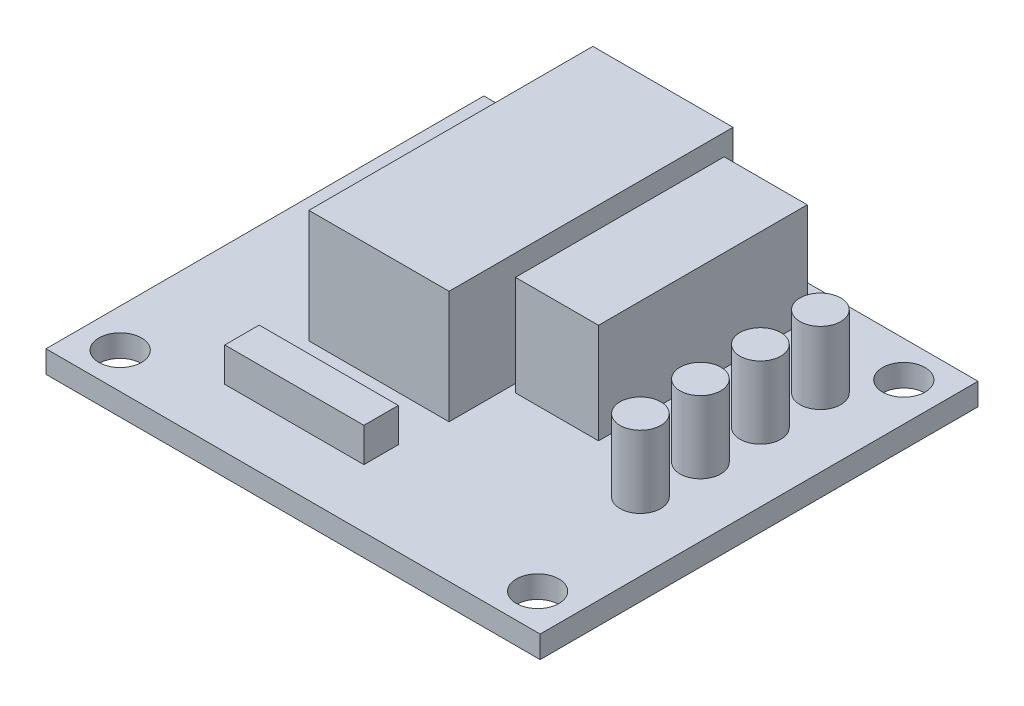
ISO-10303-21;
HEADER;
FILE_DESCRIPTION(('STEP AP214'),'2;1');
FILE_NAME('part.step','',(''),(''),'','','');
FILE_SCHEMA(('AUTOMOTIVE_DESIGN { 1 0 10303 214 1 1 1 1 }'));
ENDSEC;
DATA;
#1=APPLICATION_CONTEXT('core data for automotive mechanical design processes');
#2=APPLICATION_PROTOCOL_DEFINITION('international standard','automotive_design',2000,#1);
#3=PRODUCT_CONTEXT('',#1,'mechanical');
#4=PRODUCT('Part','Part','',(#3));
#5=PRODUCT_RELATED_PRODUCT_CATEGORY('part','',(#4));
#6=PRODUCT_DEFINITION_FORMATION('','',#4);
#7=PRODUCT_DEFINITION_CONTEXT('part definition',#1,'design');
#8=PRODUCT_DEFINITION('design','',#6,#7);
#9=PRODUCT_DEFINITION_SHAPE('','',#8);
#10=(LENGTH_UNIT() NAMED_UNIT(*) SI_UNIT(.MILLI.,.METRE.));
#11=(NAMED_UNIT(*) PLANE_ANGLE_UNIT() SI_UNIT($,.RADIAN.));
#12=(NAMED_UNIT(*) SI_UNIT($,.STERADIAN.) SOLID_ANGLE_UNIT());
#13=UNCERTAINTY_MEASURE_WITH_UNIT(LENGTH_MEASURE(1.E-05),#10,'distance_accuracy_value','');
#14=(GEOMETRIC_REPRESENTATION_CONTEXT(3) GLOBAL_UNCERTAINTY_ASSIGNED_CONTEXT((#13)) GLOBAL_UNIT_ASSIGNED_CONTEXT((#10,
#11,#12)) REPRESENTATION_CONTEXT('',''));
#15=CARTESIAN_POINT('',(0.,0.,0.));
#16=DIRECTION('',(0.,0.,1.));
#17=DIRECTION('',(1.,0.,0.));
#18=AXIS2_PLACEMENT_3D('',#15,#16,#17);
#19=CARTESIAN_POINT('',(0.,1.5875,0.));
#20=DIRECTION('',(0.,1.,0.));
#21=DIRECTION('',(0.,0.,1.));
#22=AXIS2_PLACEMENT_3D('',#19,#20,#21);
#23=PLANE('',#22);
#24=CARTESIAN_POINT('',(12.7635,1.5875,3.57505));
#25=DIRECTION('',(0.,1.,0.));
#26=DIRECTION('',(0.,0.,1.));
#27=AXIS2_PLACEMENT_3D('',#24,#25,#26);
#28=CIRCLE('',#27,1.4605);
#29=CARTESIAN_POINT('',(12.7635,1.5875,5.03555));
#30=VERTEX_POINT('',#29);
#31=EDGE_CURVE('E583',#30,#30,#28,.T.);
#32=ORIENTED_EDGE('',*,*,#31,.F.);
#33=EDGE_LOOP('',(#32));
#34=FACE_BOUND('',#33,.T.);
#35=CARTESIAN_POINT('',(12.7635,1.5875,-0.717549999999997));
#36=DIRECTION('',(0.,1.,0.));
#37=DIRECTION('',(0.,0.,1.));
#38=AXIS2_PLACEMENT_3D('',#35,#36,#37);
#39=CIRCLE('',#38,1.4605);
#40=CARTESIAN_POINT('',(12.7635,1.5875,0.742950000000003));
#41=VERTEX_POINT('',#40);
#42=EDGE_CURVE('E582',#41,#41,#39,.T.);
#43=ORIENTED_EDGE('',*,*,#42,.F.);
#44=EDGE_LOOP('',(#43));
#45=FACE_BOUND('',#44,.T.);
#46=CARTESIAN_POINT('',(12.7635,1.5875,-5.01015));
#47=DIRECTION('',(0.,1.,0.));
#48=DIRECTION('',(0.,0.,1.));
#49=AXIS2_PLACEMENT_3D('',#46,#47,#48);
#50=CIRCLE('',#49,1.4605);
#51=CARTESIAN_POINT('',(12.7635,1.5875,-3.54965));
#52=VERTEX_POINT('',#51);
#53=EDGE_CURVE('E595',#52,#52,#50,.T.);
#54=ORIENTED_EDGE('',*,*,#53,.F.);
#55=EDGE_LOOP('',(#54));
#56=FACE_BOUND('',#55,.T.);
#57=CARTESIAN_POINT('',(12.7635,1.5875,-9.30275));
#58=DIRECTION('',(0.,1.,0.));
#59=DIRECTION('',(0.,0.,1.));
#60=AXIS2_PLACEMENT_3D('',#57,#58,#59);
#61=CIRCLE('',#60,1.4605);
#62=CARTESIAN_POINT('',(12.7635,1.5875,-7.84225));
#63=VERTEX_POINT('',#62);
#64=EDGE_CURVE('E601',#63,#63,#61,.T.);
#65=ORIENTED_EDGE('',*,*,#64,.F.);
#66=EDGE_LOOP('',(#65));
#67=FACE_BOUND('',#66,.T.);
#68=CARTESIAN_POINT('',(-14.9352,1.5875,13.10005));
#69=DIRECTION('',(0.,1.,0.));
#70=DIRECTION('',(0.,0.,-1.));
#71=AXIS2_PLACEMENT_3D('',#68,#69,#70);
#72=CIRCLE('',#71,1.524);
#73=CARTESIAN_POINT('',(-14.9352,1.5875,11.57605));
#74=VERTEX_POINT('',#73);
#75=EDGE_CURVE('E343',#74,#74,#72,.T.);
#76=ORIENTED_EDGE('',*,*,#75,.F.);
#77=EDGE_LOOP('',(#76));
#78=FACE_BOUND('',#77,.T.);
#79=CARTESIAN_POINT('',(14.9352,1.5875,13.10005));
#80=DIRECTION('',(0.,1.,0.));
#81=DIRECTION('',(0.,0.,1.));
#82=AXIS2_PLACEMENT_3D('',#79,#80,#81);
#83=CIRCLE('',#82,1.524);
#84=CARTESIAN_POINT('',(14.9352,1.5875,14.62405));
#85=VERTEX_POINT('',#84);
#86=EDGE_CURVE('E359',#85,#85,#83,.T.);
#87=ORIENTED_EDGE('',*,*,#86,.F.);
#88=EDGE_LOOP('',(#87));
#89=FACE_BOUND('',#88,.T.);
#90=DIRECTION('',(0.,0.,-1.));
#91=VECTOR('',#90,1.);
#92=CARTESIAN_POINT('',(17.6784,1.5875,-15.66545));
#93=LINE('',#92,#91);
#94=CARTESIAN_POINT('',(17.6784,1.5875,15.66545));
#95=VERTEX_POINT('',#94);
#96=CARTESIAN_POINT('',(17.6784,1.5875,-15.66545));
#97=VERTEX_POINT('',#96);
#98=EDGE_CURVE('E367',#95,#97,#93,.T.);
#99=ORIENTED_EDGE('',*,*,#98,.T.);
#100=DIRECTION('',(-1.,0.,0.));
#101=VECTOR('',#100,1.);
#102=CARTESIAN_POINT('',(-17.6784,1.5875,-15.66545));
#103=LINE('',#102,#101);
#104=CARTESIAN_POINT('',(-17.6784,1.5875,-15.66545));
#105=VERTEX_POINT('',#104);
#106=EDGE_CURVE('E371',#97,#105,#103,.T.);
#107=ORIENTED_EDGE('',*,*,#106,.T.);
#108=DIRECTION('',(0.,0.,1.));
#109=VECTOR('',#108,1.);
#110=CARTESIAN_POINT('',(-17.6784,1.5875,-15.66545));
#111=LINE('',#110,#109);
#112=CARTESIAN_POINT('',(-17.6784,1.5875,15.66545));
#113=VERTEX_POINT('',#112);
#114=EDGE_CURVE('E375',#105,#113,#111,.T.);
#115=ORIENTED_EDGE('',*,*,#114,.T.);
#116=DIRECTION('',(1.,0.,0.));
#117=VECTOR('',#116,1.);
#118=CARTESIAN_POINT('',(-17.6784,1.5875,15.66545));
#119=LINE('',#118,#117);
#120=EDGE_CURVE('E378',#113,#95,#119,.T.);
#121=ORIENTED_EDGE('',*,*,#120,.T.);
#122=EDGE_LOOP('',(#99,#107,#115,#121));
#123=FACE_BOUND('',#122,.T.);
#124=CARTESIAN_POINT('',(14.9352,1.5875,-13.10005));
#125=DIRECTION('',(0.,1.,0.));
#126=DIRECTION('',(0.,0.,-1.));
#127=AXIS2_PLACEMENT_3D('',#124,#125,#126);
#128=CIRCLE('',#127,1.524);
#129=CARTESIAN_POINT('',(14.9352,1.5875,-14.62405));
#130=VERTEX_POINT('',#129);
#131=EDGE_CURVE('E351',#130,#130,#128,.T.);
#132=ORIENTED_EDGE('',*,*,#131,.F.);
#133=EDGE_LOOP('',(#132));
#134=FACE_BOUND('',#133,.T.);
#135=CARTESIAN_POINT('',(-14.9352,1.5875,-13.10005));
#136=DIRECTION('',(0.,1.,0.));
#137=DIRECTION('',(0.,0.,1.));
#138=AXIS2_PLACEMENT_3D('',#135,#136,#137);
#139=CIRCLE('',#138,1.524);
#140=CARTESIAN_POINT('',(-14.9352,1.5875,-11.57605));
#141=VERTEX_POINT('',#140);
#142=EDGE_CURVE('E335',#141,#141,#139,.T.);
#143=ORIENTED_EDGE('',*,*,#142,.F.);
#144=EDGE_LOOP('',(#143));
#145=FACE_BOUND('',#144,.T.);
#146=DIRECTION('',(-1.,0.,0.));
#147=VECTOR('',#146,1.);
#148=CARTESIAN_POINT('',(-12.1666,1.5875,-10.29335));
#149=LINE('',#148,#147);
#150=CARTESIAN_POINT('',(-9.7028,1.5875,-10.29335));
#151=VERTEX_POINT('',#150);
#152=CARTESIAN_POINT('',(-12.1666,1.5875,-10.29335));
#153=VERTEX_POINT('',#152);
#154=EDGE_CURVE('E312',#151,#153,#149,.T.);
#155=ORIENTED_EDGE('',*,*,#154,.F.);
#156=DIRECTION('',(0.,0.,-1.));
#157=VECTOR('',#156,1.);
#158=CARTESIAN_POINT('',(-9.7028,1.5875,-0.336549999999998));
#159=LINE('',#158,#157);
#160=CARTESIAN_POINT('',(-9.7028,1.5875,-0.336549999999998));
#161=VERTEX_POINT('',#160);
#162=EDGE_CURVE('E293',#161,#151,#159,.T.);
#163=ORIENTED_EDGE('',*,*,#162,.F.);
#164=DIRECTION('',(1.,0.,0.));
#165=VECTOR('',#164,1.);
#166=CARTESIAN_POINT('',(-12.1666,1.5875,-0.336549999999998));
#167=LINE('',#166,#165);
#168=CARTESIAN_POINT('',(-12.1666,1.5875,-0.336549999999998));
#169=VERTEX_POINT('',#168);
#170=EDGE_CURVE('E299',#169,#161,#167,.T.);
#171=ORIENTED_EDGE('',*,*,#170,.F.);
#172=DIRECTION('',(0.,0.,1.));
#173=VECTOR('',#172,1.);
#174=CARTESIAN_POINT('',(-12.1666,1.5875,-0.336549999999998));
#175=LINE('',#174,#173);
#176=EDGE_CURVE('E315',#153,#169,#175,.T.);
#177=ORIENTED_EDGE('',*,*,#176,.F.);
#178=EDGE_LOOP('',(#155,#163,#171,#177));
#179=FACE_BOUND('',#178,.T.);
#180=DIRECTION('',(-1.,0.,0.));
#181=VECTOR('',#180,1.);
#182=CARTESIAN_POINT('',(-9.08050000000001,1.5875,9.01065));
#183=LINE('',#182,#181);
#184=CARTESIAN_POINT('',(0.876299999999995,1.5875,9.01065));
#185=VERTEX_POINT('',#184);
#186=CARTESIAN_POINT('',(-9.08050000000001,1.5875,9.01065));
#187=VERTEX_POINT('',#186);
#188=EDGE_CURVE('E271',#185,#187,#183,.T.);
#189=ORIENTED_EDGE('',*,*,#188,.F.);
#190=DIRECTION('',(0.,0.,-1.));
#191=VECTOR('',#190,1.);
#192=CARTESIAN_POINT('',(0.876299999999995,1.5875,9.01065));
#193=LINE('',#192,#191);
#194=CARTESIAN_POINT('',(0.876299999999995,1.5875,11.47445));
#195=VERTEX_POINT('',#194);
#196=EDGE_CURVE('E252',#195,#185,#193,.T.);
#197=ORIENTED_EDGE('',*,*,#196,.F.);
#198=DIRECTION('',(1.,0.,0.));
#199=VECTOR('',#198,1.);
#200=CARTESIAN_POINT('',(-9.0805,1.5875,11.47445));
#201=LINE('',#200,#199);
#202=CARTESIAN_POINT('',(-9.0805,1.5875,11.47445));
#203=VERTEX_POINT('',#202);
#204=EDGE_CURVE('E258',#203,#195,#201,.T.);
#205=ORIENTED_EDGE('',*,*,#204,.F.);
#206=DIRECTION('',(0.,0.,1.));
#207=VECTOR('',#206,1.);
#208=CARTESIAN_POINT('',(-9.08050000000001,1.5875,9.01065));
#209=LINE('',#208,#207);
#210=EDGE_CURVE('E274',#187,#203,#209,.T.);
#211=ORIENTED_EDGE('',*,*,#210,.F.);
#212=EDGE_LOOP('',(#189,#197,#205,#211));
#213=FACE_BOUND('',#212,.T.);
#214=DIRECTION('',(1.,0.,0.));
#215=VECTOR('',#214,1.);
#216=CARTESIAN_POINT('',(-8.763,1.5875,5.77215));
#217=LINE('',#216,#215);
#218=CARTESIAN_POINT('',(-8.763,1.5875,5.77215));
#219=VERTEX_POINT('',#218);
#220=CARTESIAN_POINT('',(1.27,1.5875,5.77215));
#221=VERTEX_POINT('',#220);
#222=EDGE_CURVE('E213',#219,#221,#217,.T.);
#223=ORIENTED_EDGE('',*,*,#222,.F.);
#224=DIRECTION('',(0.,0.,1.));
#225=VECTOR('',#224,1.);
#226=CARTESIAN_POINT('',(-8.76300000000001,1.5875,-14.54785));
#227=LINE('',#226,#225);
#228=CARTESIAN_POINT('',(-8.76300000000001,1.5875,-14.54785));
#229=VERTEX_POINT('',#228);
#230=EDGE_CURVE('E208',#229,#219,#227,.T.);
#231=ORIENTED_EDGE('',*,*,#230,.F.);
#232=DIRECTION('',(-1.,0.,0.));
#233=VECTOR('',#232,1.);
#234=CARTESIAN_POINT('',(-8.76300000000001,1.5875,-14.54785));
#235=LINE('',#234,#233);
#236=CARTESIAN_POINT('',(1.26999999999999,1.5875,-14.54785));
#237=VERTEX_POINT('',#236);
#238=EDGE_CURVE('E223',#237,#229,#235,.T.);
#239=ORIENTED_EDGE('',*,*,#238,.F.);
#240=DIRECTION('',(0.,0.,-1.));
#241=VECTOR('',#240,1.);
#242=CARTESIAN_POINT('',(1.26999999999999,1.5875,-14.54785));
#243=LINE('',#242,#241);
#244=EDGE_CURVE('E235',#221,#237,#243,.T.);
#245=ORIENTED_EDGE('',*,*,#244,.F.);
#246=EDGE_LOOP('',(#223,#231,#239,#245));
#247=FACE_BOUND('',#246,.T.);
#248=DIRECTION('',(1.,0.,0.));
#249=VECTOR('',#248,1.);
#250=CARTESIAN_POINT('',(1.8542,1.5875,1.60655));
#251=LINE('',#250,#249);
#252=CARTESIAN_POINT('',(1.8542,1.5875,1.60655));
#253=VERTEX_POINT('',#252);
#254=CARTESIAN_POINT('',(7.7978,1.5875,1.60655));
#255=VERTEX_POINT('',#254);
#256=EDGE_CURVE('E619',#253,#255,#251,.T.);
#257=ORIENTED_EDGE('',*,*,#256,.F.);
#258=DIRECTION('',(0.,0.,1.));
#259=VECTOR('',#258,1.);
#260=CARTESIAN_POINT('',(1.8542,1.5875,-13.32865));
#261=LINE('',#260,#259);
#262=CARTESIAN_POINT('',(1.8542,1.5875,-13.32865));
#263=VERTEX_POINT('',#262);
#264=EDGE_CURVE('E205',#263,#253,#261,.T.);
#265=ORIENTED_EDGE('',*,*,#264,.F.);
#266=DIRECTION('',(-1.,0.,0.));
#267=VECTOR('',#266,1.);
#268=CARTESIAN_POINT('',(1.8542,1.5875,-13.32865));
#269=LINE('',#268,#267);
#270=CARTESIAN_POINT('',(7.7978,1.5875,-13.32865));
#271=VERTEX_POINT('',#270);
#272=EDGE_CURVE('E201',#271,#263,#269,.T.);
#273=ORIENTED_EDGE('',*,*,#272,.F.);
#274=DIRECTION('',(0.,0.,-1.));
#275=VECTOR('',#274,1.);
#276=CARTESIAN_POINT('',(7.7978,1.5875,-13.32865));
#277=LINE('',#276,#275);
#278=EDGE_CURVE('E622',#255,#271,#277,.T.);
#279=ORIENTED_EDGE('',*,*,#278,.F.);
#280=EDGE_LOOP('',(#257,#265,#273,#279));
#281=FACE_BOUND('',#280,.T.);
#282=ADVANCED_FACE('F41',(#34,#45,#56,#67,#78,#89,#123,#134,#145,#179,#213,#247,#281),#23,.T.);
#283=CARTESIAN_POINT('',(0.,0.,0.));
#284=DIRECTION('',(0.,1.,0.));
#285=DIRECTION('',(0.,0.,1.));
#286=AXIS2_PLACEMENT_3D('',#283,#284,#285);
#287=PLANE('',#286);
#288=DIRECTION('',(0.,0.,-1.));
#289=VECTOR('',#288,1.);
#290=CARTESIAN_POINT('',(17.6784,0.,-15.66545));
#291=LINE('',#290,#289);
#292=CARTESIAN_POINT('',(17.6784,0.,15.66545));
#293=VERTEX_POINT('',#292);
#294=CARTESIAN_POINT('',(17.6784,0.,-15.66545));
#295=VERTEX_POINT('',#294);
#296=EDGE_CURVE('E363',#293,#295,#291,.T.);
#297=ORIENTED_EDGE('',*,*,#296,.F.);
#298=DIRECTION('',(1.,0.,0.));
#299=VECTOR('',#298,1.);
#300=CARTESIAN_POINT('',(-17.6784,0.,15.66545));
#301=LINE('',#300,#299);
#302=CARTESIAN_POINT('',(-17.6784,0.,15.66545));
#303=VERTEX_POINT('',#302);
#304=EDGE_CURVE('E372',#303,#293,#301,.T.);
#305=ORIENTED_EDGE('',*,*,#304,.F.);
#306=DIRECTION('',(0.,0.,1.));
#307=VECTOR('',#306,1.);
#308=CARTESIAN_POINT('',(-17.6784,0.,-15.66545));
#309=LINE('',#308,#307);
#310=CARTESIAN_POINT('',(-17.6784,0.,-15.66545));
#311=VERTEX_POINT('',#310);
#312=EDGE_CURVE('E388',#311,#303,#309,.T.);
#313=ORIENTED_EDGE('',*,*,#312,.F.);
#314=DIRECTION('',(-1.,0.,0.));
#315=VECTOR('',#314,1.);
#316=CARTESIAN_POINT('',(-17.6784,0.,-15.66545));
#317=LINE('',#316,#315);
#318=EDGE_CURVE('E385',#295,#311,#317,.T.);
#319=ORIENTED_EDGE('',*,*,#318,.F.);
#320=EDGE_LOOP('',(#297,#305,#313,#319));
#321=FACE_BOUND('',#320,.T.);
#322=CARTESIAN_POINT('',(14.9352,0.,13.10005));
#323=DIRECTION('',(0.,1.,0.));
#324=DIRECTION('',(0.,0.,1.));
#325=AXIS2_PLACEMENT_3D('',#322,#323,#324);
#326=CIRCLE('',#325,1.524);
#327=CARTESIAN_POINT('',(14.9352,0.,14.62405));
#328=VERTEX_POINT('',#327);
#329=EDGE_CURVE('E355',#328,#328,#326,.T.);
#330=ORIENTED_EDGE('',*,*,#329,.T.);
#331=EDGE_LOOP('',(#330));
#332=FACE_BOUND('',#331,.T.);
#333=CARTESIAN_POINT('',(14.9352,0.,-13.10005));
#334=DIRECTION('',(0.,1.,0.));
#335=DIRECTION('',(0.,0.,-1.));
#336=AXIS2_PLACEMENT_3D('',#333,#334,#335);
#337=CIRCLE('',#336,1.524);
#338=CARTESIAN_POINT('',(14.9352,0.,-14.62405));
#339=VERTEX_POINT('',#338);
#340=EDGE_CURVE('E347',#339,#339,#337,.T.);
#341=ORIENTED_EDGE('',*,*,#340,.T.);
#342=EDGE_LOOP('',(#341));
#343=FACE_BOUND('',#342,.T.);
#344=CARTESIAN_POINT('',(-14.9352,0.,13.10005));
#345=DIRECTION('',(0.,1.,0.));
#346=DIRECTION('',(0.,0.,-1.));
#347=AXIS2_PLACEMENT_3D('',#344,#345,#346);
#348=CIRCLE('',#347,1.524);
#349=CARTESIAN_POINT('',(-14.9352,0.,11.57605));
#350=VERTEX_POINT('',#349);
#351=EDGE_CURVE('E339',#350,#350,#348,.T.);
#352=ORIENTED_EDGE('',*,*,#351,.T.);
#353=EDGE_LOOP('',(#352));
#354=FACE_BOUND('',#353,.T.);
#355=CARTESIAN_POINT('',(-14.9352,0.,-13.10005));
#356=DIRECTION('',(0.,1.,0.));
#357=DIRECTION('',(0.,0.,1.));
#358=AXIS2_PLACEMENT_3D('',#355,#356,#357);
#359=CIRCLE('',#358,1.524);
#360=CARTESIAN_POINT('',(-14.9352,0.,-11.57605));
#361=VERTEX_POINT('',#360);
#362=EDGE_CURVE('E334',#361,#361,#359,.T.);
#363=ORIENTED_EDGE('',*,*,#362,.T.);
#364=EDGE_LOOP('',(#363));
#365=FACE_BOUND('',#364,.T.);
#366=ADVANCED_FACE('F411',(#321,#332,#343,#354,#365),#287,.F.);
#367=CARTESIAN_POINT('',(17.6784,1.5875,-15.66545));
#368=DIRECTION('',(-1.,0.,0.));
#369=DIRECTION('',(0.,0.,1.));
#370=AXIS2_PLACEMENT_3D('',#367,#368,#369);
#371=PLANE('',#370);
#372=ORIENTED_EDGE('',*,*,#296,.T.);
#373=DIRECTION('',(0.,-1.,0.));
#374=VECTOR('',#373,1.);
#375=CARTESIAN_POINT('',(17.6784,1.5875,-15.66545));
#376=LINE('',#375,#374);
#377=EDGE_CURVE('E11',#97,#295,#376,.T.);
#378=ORIENTED_EDGE('',*,*,#377,.F.);
#379=ORIENTED_EDGE('',*,*,#98,.F.);
#380=DIRECTION('',(0.,-1.,0.));
#381=VECTOR('',#380,1.);
#382=CARTESIAN_POINT('',(17.6784,1.5875,15.66545));
#383=LINE('',#382,#381);
#384=EDGE_CURVE('E381',#95,#293,#383,.T.);
#385=ORIENTED_EDGE('',*,*,#384,.T.);
#386=EDGE_LOOP('',(#372,#378,#379,#385));
#387=FACE_BOUND('',#386,.T.);
#388=ADVANCED_FACE('F43',(#387),#371,.F.);
#389=CARTESIAN_POINT('',(-17.6784,1.5875,-15.66545));
#390=DIRECTION('',(0.,0.,1.));
#391=DIRECTION('',(1.,0.,0.));
#392=AXIS2_PLACEMENT_3D('',#389,#390,#391);
#393=PLANE('',#392);
#394=ORIENTED_EDGE('',*,*,#318,.T.);
#395=DIRECTION('',(0.,-1.,0.));
#396=VECTOR('',#395,1.);
#397=CARTESIAN_POINT('',(-17.6784,1.5875,-15.66545));
#398=LINE('',#397,#396);
#399=EDGE_CURVE('E50',#105,#311,#398,.T.);
#400=ORIENTED_EDGE('',*,*,#399,.F.);
#401=ORIENTED_EDGE('',*,*,#106,.F.);
#402=ORIENTED_EDGE('',*,*,#377,.T.);
#403=EDGE_LOOP('',(#394,#400,#401,#402));
#404=FACE_BOUND('',#403,.T.);
#405=ADVANCED_FACE('F422',(#404),#393,.F.);
#406=CARTESIAN_POINT('',(-17.6784,1.5875,-15.66545));
#407=DIRECTION('',(1.,0.,0.));
#408=DIRECTION('',(0.,0.,-1.));
#409=AXIS2_PLACEMENT_3D('',#406,#407,#408);
#410=PLANE('',#409);
#411=ORIENTED_EDGE('',*,*,#312,.T.);
#412=DIRECTION('',(0.,-1.,0.));
#413=VECTOR('',#412,1.);
#414=CARTESIAN_POINT('',(-17.6784,1.5875,15.66545));
#415=LINE('',#414,#413);
#416=EDGE_CURVE('E396',#113,#303,#415,.T.);
#417=ORIENTED_EDGE('',*,*,#416,.F.);
#418=ORIENTED_EDGE('',*,*,#114,.F.);
#419=ORIENTED_EDGE('',*,*,#399,.T.);
#420=EDGE_LOOP('',(#411,#417,#418,#419));
#421=FACE_BOUND('',#420,.T.);
#422=ADVANCED_FACE('F405',(#421),#410,.F.);
#423=CARTESIAN_POINT('',(-17.6784,1.5875,15.66545));
#424=DIRECTION('',(0.,0.,-1.));
#425=DIRECTION('',(-1.,0.,0.));
#426=AXIS2_PLACEMENT_3D('',#423,#424,#425);
#427=PLANE('',#426);
#428=ORIENTED_EDGE('',*,*,#304,.T.);
#429=ORIENTED_EDGE('',*,*,#384,.F.);
#430=ORIENTED_EDGE('',*,*,#120,.F.);
#431=ORIENTED_EDGE('',*,*,#416,.T.);
#432=EDGE_LOOP('',(#428,#429,#430,#431));
#433=FACE_BOUND('',#432,.T.);
#434=ADVANCED_FACE('F415',(#433),#427,.F.);
#435=CARTESIAN_POINT('',(14.9352,1.5875,13.10005));
#436=DIRECTION('',(0.,-1.,0.));
#437=DIRECTION('',(0.,0.,-1.));
#438=AXIS2_PLACEMENT_3D('',#435,#436,#437);
#439=CYLINDRICAL_SURFACE('',#438,1.524);
#440=ORIENTED_EDGE('',*,*,#86,.T.);
#441=EDGE_LOOP('',(#440));
#442=FACE_BOUND('',#441,.T.);
#443=ORIENTED_EDGE('',*,*,#329,.F.);
#444=EDGE_LOOP('',(#443));
#445=FACE_BOUND('',#444,.T.);
#446=ADVANCED_FACE('F439',(#442,#445),#439,.F.);
#447=CARTESIAN_POINT('',(14.9352,1.5875,-13.10005));
#448=DIRECTION('',(0.,-1.,0.));
#449=DIRECTION('',(0.,0.,-1.));
#450=AXIS2_PLACEMENT_3D('',#447,#448,#449);
#451=CYLINDRICAL_SURFACE('',#450,1.524);
#452=ORIENTED_EDGE('',*,*,#131,.T.);
#453=EDGE_LOOP('',(#452));
#454=FACE_BOUND('',#453,.T.);
#455=ORIENTED_EDGE('',*,*,#340,.F.);
#456=EDGE_LOOP('',(#455));
#457=FACE_BOUND('',#456,.T.);
#458=ADVANCED_FACE('F446',(#454,#457),#451,.F.);
#459=CARTESIAN_POINT('',(-14.9352,1.5875,13.10005));
#460=DIRECTION('',(0.,-1.,0.));
#461=DIRECTION('',(0.,0.,-1.));
#462=AXIS2_PLACEMENT_3D('',#459,#460,#461);
#463=CYLINDRICAL_SURFACE('',#462,1.524);
#464=ORIENTED_EDGE('',*,*,#75,.T.);
#465=EDGE_LOOP('',(#464));
#466=FACE_BOUND('',#465,.T.);
#467=ORIENTED_EDGE('',*,*,#351,.F.);
#468=EDGE_LOOP('',(#467));
#469=FACE_BOUND('',#468,.T.);
#470=ADVANCED_FACE('F451',(#466,#469),#463,.F.);
#471=CARTESIAN_POINT('',(-14.9352,1.5875,-13.10005));
#472=DIRECTION('',(0.,-1.,0.));
#473=DIRECTION('',(0.,0.,-1.));
#474=AXIS2_PLACEMENT_3D('',#471,#472,#473);
#475=CYLINDRICAL_SURFACE('',#474,1.524);
#476=ORIENTED_EDGE('',*,*,#142,.T.);
#477=EDGE_LOOP('',(#476));
#478=FACE_BOUND('',#477,.T.);
#479=ORIENTED_EDGE('',*,*,#362,.F.);
#480=EDGE_LOOP('',(#479));
#481=FACE_BOUND('',#480,.T.);
#482=ADVANCED_FACE('F463',(#478,#481),#475,.F.);
#483=CARTESIAN_POINT('',(-9.7028,4.0259,-0.336549999999998));
#484=DIRECTION('',(-1.,0.,0.));
#485=DIRECTION('',(0.,0.,1.));
#486=AXIS2_PLACEMENT_3D('',#483,#484,#485);
#487=PLANE('',#486);
#488=ORIENTED_EDGE('',*,*,#162,.T.);
#489=DIRECTION('',(0.,-1.,0.));
#490=VECTOR('',#489,1.);
#491=CARTESIAN_POINT('',(-9.7028,4.0259,-10.29335));
#492=LINE('',#491,#490);
#493=CARTESIAN_POINT('',(-9.7028,4.0259,-10.29335));
#494=VERTEX_POINT('',#493);
#495=EDGE_CURVE('E331',#494,#151,#492,.T.);
#496=ORIENTED_EDGE('',*,*,#495,.F.);
#497=DIRECTION('',(0.,0.,-1.));
#498=VECTOR('',#497,1.);
#499=CARTESIAN_POINT('',(-9.7028,4.0259,-0.336549999999998));
#500=LINE('',#499,#498);
#501=CARTESIAN_POINT('',(-9.7028,4.0259,-0.336549999999998));
#502=VERTEX_POINT('',#501);
#503=EDGE_CURVE('E294',#502,#494,#500,.T.);
#504=ORIENTED_EDGE('',*,*,#503,.F.);
#505=DIRECTION('',(0.,-1.,0.));
#506=VECTOR('',#505,1.);
#507=CARTESIAN_POINT('',(-9.7028,4.0259,-0.336549999999998));
#508=LINE('',#507,#506);
#509=EDGE_CURVE('E308',#502,#161,#508,.T.);
#510=ORIENTED_EDGE('',*,*,#509,.T.);
#511=EDGE_LOOP('',(#488,#496,#504,#510));
#512=FACE_BOUND('',#511,.T.);
#513=ADVANCED_FACE('F465',(#512),#487,.F.);
#514=CARTESIAN_POINT('',(-12.1666,4.0259,-10.29335));
#515=DIRECTION('',(0.,0.,1.));
#516=DIRECTION('',(1.,0.,0.));
#517=AXIS2_PLACEMENT_3D('',#514,#515,#516);
#518=PLANE('',#517);
#519=ORIENTED_EDGE('',*,*,#154,.T.);
#520=DIRECTION('',(0.,-1.,0.));
#521=VECTOR('',#520,1.);
#522=CARTESIAN_POINT('',(-12.1666,4.0259,-10.29335));
#523=LINE('',#522,#521);
#524=CARTESIAN_POINT('',(-12.1666,4.0259,-10.29335));
#525=VERTEX_POINT('',#524);
#526=EDGE_CURVE('E327',#525,#153,#523,.T.);
#527=ORIENTED_EDGE('',*,*,#526,.F.);
#528=DIRECTION('',(-1.,0.,0.));
#529=VECTOR('',#528,1.);
#530=CARTESIAN_POINT('',(-12.1666,4.0259,-10.29335));
#531=LINE('',#530,#529);
#532=EDGE_CURVE('E298',#494,#525,#531,.T.);
#533=ORIENTED_EDGE('',*,*,#532,.F.);
#534=ORIENTED_EDGE('',*,*,#495,.T.);
#535=EDGE_LOOP('',(#519,#527,#533,#534));
#536=FACE_BOUND('',#535,.T.);
#537=ADVANCED_FACE('F472',(#536),#518,.F.);
#538=CARTESIAN_POINT('',(-12.1666,4.0259,-0.336549999999998));
#539=DIRECTION('',(1.,0.,0.));
#540=DIRECTION('',(0.,0.,-1.));
#541=AXIS2_PLACEMENT_3D('',#538,#539,#540);
#542=PLANE('',#541);
#543=ORIENTED_EDGE('',*,*,#176,.T.);
#544=DIRECTION('',(0.,-1.,0.));
#545=VECTOR('',#544,1.);
#546=CARTESIAN_POINT('',(-12.1666,4.0259,-0.336549999999998));
#547=LINE('',#546,#545);
#548=CARTESIAN_POINT('',(-12.1666,4.0259,-0.336549999999998));
#549=VERTEX_POINT('',#548);
#550=EDGE_CURVE('E324',#549,#169,#547,.T.);
#551=ORIENTED_EDGE('',*,*,#550,.F.);
#552=DIRECTION('',(0.,0.,1.));
#553=VECTOR('',#552,1.);
#554=CARTESIAN_POINT('',(-12.1666,4.0259,-0.336549999999998));
#555=LINE('',#554,#553);
#556=EDGE_CURVE('E302',#525,#549,#555,.T.);
#557=ORIENTED_EDGE('',*,*,#556,.F.);
#558=ORIENTED_EDGE('',*,*,#526,.T.);
#559=EDGE_LOOP('',(#543,#551,#557,#558));
#560=FACE_BOUND('',#559,.T.);
#561=ADVANCED_FACE('F480',(#560),#542,.F.);
#562=CARTESIAN_POINT('',(-12.1666,4.0259,-0.336549999999998));
#563=DIRECTION('',(0.,0.,-1.));
#564=DIRECTION('',(-1.,0.,0.));
#565=AXIS2_PLACEMENT_3D('',#562,#563,#564);
#566=PLANE('',#565);
#567=ORIENTED_EDGE('',*,*,#170,.T.);
#568=ORIENTED_EDGE('',*,*,#509,.F.);
#569=DIRECTION('',(1.,0.,0.));
#570=VECTOR('',#569,1.);
#571=CARTESIAN_POINT('',(-12.1666,4.0259,-0.336549999999998));
#572=LINE('',#571,#570);
#573=EDGE_CURVE('E305',#549,#502,#572,.T.);
#574=ORIENTED_EDGE('',*,*,#573,.F.);
#575=ORIENTED_EDGE('',*,*,#550,.T.);
#576=EDGE_LOOP('',(#567,#568,#574,#575));
#577=FACE_BOUND('',#576,.T.);
#578=ADVANCED_FACE('F484',(#577),#566,.F.);
#579=CARTESIAN_POINT('',(0.,4.0259,0.));
#580=DIRECTION('',(0.,-1.,0.));
#581=DIRECTION('',(0.,0.,-1.));
#582=AXIS2_PLACEMENT_3D('',#579,#580,#581);
#583=PLANE('',#582);
#584=ORIENTED_EDGE('',*,*,#503,.T.);
#585=ORIENTED_EDGE('',*,*,#532,.T.);
#586=ORIENTED_EDGE('',*,*,#556,.T.);
#587=ORIENTED_EDGE('',*,*,#573,.T.);
#588=EDGE_LOOP('',(#584,#585,#586,#587));
#589=FACE_BOUND('',#588,.T.);
#590=ADVANCED_FACE('F488',(#589),#583,.F.);
#591=CARTESIAN_POINT('',(0.876299999999995,4.0259,9.01065));
#592=DIRECTION('',(-1.,0.,0.));
#593=DIRECTION('',(0.,0.,1.));
#594=AXIS2_PLACEMENT_3D('',#591,#592,#593);
#595=PLANE('',#594);
#596=ORIENTED_EDGE('',*,*,#196,.T.);
#597=DIRECTION('',(0.,-1.,0.));
#598=VECTOR('',#597,1.);
#599=CARTESIAN_POINT('',(0.876299999999995,4.0259,9.01065));
#600=LINE('',#599,#598);
#601=CARTESIAN_POINT('',(0.876299999999995,4.0259,9.01065));
#602=VERTEX_POINT('',#601);
#603=EDGE_CURVE('E290',#602,#185,#600,.T.);
#604=ORIENTED_EDGE('',*,*,#603,.F.);
#605=DIRECTION('',(0.,0.,-1.));
#606=VECTOR('',#605,1.);
#607=CARTESIAN_POINT('',(0.876299999999995,4.0259,9.01065));
#608=LINE('',#607,#606);
#609=CARTESIAN_POINT('',(0.876299999999995,4.0259,11.47445));
#610=VERTEX_POINT('',#609);
#611=EDGE_CURVE('E253',#610,#602,#608,.T.);
#612=ORIENTED_EDGE('',*,*,#611,.F.);
#613=DIRECTION('',(0.,-1.,0.));
#614=VECTOR('',#613,1.);
#615=CARTESIAN_POINT('',(0.876299999999995,4.0259,11.47445));
#616=LINE('',#615,#614);
#617=EDGE_CURVE('E267',#610,#195,#616,.T.);
#618=ORIENTED_EDGE('',*,*,#617,.T.);
#619=EDGE_LOOP('',(#596,#604,#612,#618));
#620=FACE_BOUND('',#619,.T.);
#621=ADVANCED_FACE('F492',(#620),#595,.F.);
#622=CARTESIAN_POINT('',(-9.08050000000001,4.0259,9.01065));
#623=DIRECTION('',(0.,0.,1.));
#624=DIRECTION('',(1.,0.,0.));
#625=AXIS2_PLACEMENT_3D('',#622,#623,#624);
#626=PLANE('',#625);
#627=ORIENTED_EDGE('',*,*,#188,.T.);
#628=DIRECTION('',(0.,-1.,0.));
#629=VECTOR('',#628,1.);
#630=CARTESIAN_POINT('',(-9.08050000000001,4.0259,9.01065));
#631=LINE('',#630,#629);
#632=CARTESIAN_POINT('',(-9.08050000000001,4.0259,9.01065));
#633=VERTEX_POINT('',#632);
#634=EDGE_CURVE('E286',#633,#187,#631,.T.);
#635=ORIENTED_EDGE('',*,*,#634,.F.);
#636=DIRECTION('',(-1.,0.,0.));
#637=VECTOR('',#636,1.);
#638=CARTESIAN_POINT('',(-9.08050000000001,4.0259,9.01065));
#639=LINE('',#638,#637);
#640=EDGE_CURVE('E257',#602,#633,#639,.T.);
#641=ORIENTED_EDGE('',*,*,#640,.F.);
#642=ORIENTED_EDGE('',*,*,#603,.T.);
#643=EDGE_LOOP('',(#627,#635,#641,#642));
#644=FACE_BOUND('',#643,.T.);
#645=ADVANCED_FACE('F496',(#644),#626,.F.);
#646=CARTESIAN_POINT('',(-9.08050000000001,4.0259,9.01065));
#647=DIRECTION('',(1.,0.,0.));
#648=DIRECTION('',(0.,0.,-1.));
#649=AXIS2_PLACEMENT_3D('',#646,#647,#648);
#650=PLANE('',#649);
#651=ORIENTED_EDGE('',*,*,#210,.T.);
#652=DIRECTION('',(0.,-1.,0.));
#653=VECTOR('',#652,1.);
#654=CARTESIAN_POINT('',(-9.0805,4.0259,11.47445));
#655=LINE('',#654,#653);
#656=CARTESIAN_POINT('',(-9.0805,4.0259,11.47445));
#657=VERTEX_POINT('',#656);
#658=EDGE_CURVE('E283',#657,#203,#655,.T.);
#659=ORIENTED_EDGE('',*,*,#658,.F.);
#660=DIRECTION('',(0.,0.,1.));
#661=VECTOR('',#660,1.);
#662=CARTESIAN_POINT('',(-9.08050000000001,4.0259,9.01065));
#663=LINE('',#662,#661);
#664=EDGE_CURVE('E261',#633,#657,#663,.T.);
#665=ORIENTED_EDGE('',*,*,#664,.F.);
#666=ORIENTED_EDGE('',*,*,#634,.T.);
#667=EDGE_LOOP('',(#651,#659,#665,#666));
#668=FACE_BOUND('',#667,.T.);
#669=ADVANCED_FACE('F500',(#668),#650,.F.);
#670=CARTESIAN_POINT('',(-9.0805,4.0259,11.47445));
#671=DIRECTION('',(0.,0.,-1.));
#672=DIRECTION('',(-1.,0.,0.));
#673=AXIS2_PLACEMENT_3D('',#670,#671,#672);
#674=PLANE('',#673);
#675=ORIENTED_EDGE('',*,*,#204,.T.);
#676=ORIENTED_EDGE('',*,*,#617,.F.);
#677=DIRECTION('',(1.,0.,0.));
#678=VECTOR('',#677,1.);
#679=CARTESIAN_POINT('',(-9.0805,4.0259,11.47445));
#680=LINE('',#679,#678);
#681=EDGE_CURVE('E264',#657,#610,#680,.T.);
#682=ORIENTED_EDGE('',*,*,#681,.F.);
#683=ORIENTED_EDGE('',*,*,#658,.T.);
#684=EDGE_LOOP('',(#675,#676,#682,#683));
#685=FACE_BOUND('',#684,.T.);
#686=ADVANCED_FACE('F504',(#685),#674,.F.);
#687=CARTESIAN_POINT('',(0.,4.0259,0.));
#688=DIRECTION('',(0.,1.,0.));
#689=DIRECTION('',(0.,0.,1.));
#690=AXIS2_PLACEMENT_3D('',#687,#688,#689);
#691=PLANE('',#690);
#692=ORIENTED_EDGE('',*,*,#611,.T.);
#693=ORIENTED_EDGE('',*,*,#640,.T.);
#694=ORIENTED_EDGE('',*,*,#664,.T.);
#695=ORIENTED_EDGE('',*,*,#681,.T.);
#696=EDGE_LOOP('',(#692,#693,#694,#695));
#697=FACE_BOUND('',#696,.T.);
#698=ADVANCED_FACE('F508',(#697),#691,.T.);
#699=CARTESIAN_POINT('',(-8.76300000000001,9.6774,-14.54785));
#700=DIRECTION('',(1.,0.,0.));
#701=DIRECTION('',(0.,0.,-1.));
#702=AXIS2_PLACEMENT_3D('',#699,#700,#701);
#703=PLANE('',#702);
#704=ORIENTED_EDGE('',*,*,#230,.T.);
#705=DIRECTION('',(0.,-1.,0.));
#706=VECTOR('',#705,1.);
#707=CARTESIAN_POINT('',(-8.763,9.6774,5.77215));
#708=LINE('',#707,#706);
#709=CARTESIAN_POINT('',(-8.763,9.6774,5.77215));
#710=VERTEX_POINT('',#709);
#711=EDGE_CURVE('E249',#710,#219,#708,.T.);
#712=ORIENTED_EDGE('',*,*,#711,.F.);
#713=DIRECTION('',(0.,0.,1.));
#714=VECTOR('',#713,1.);
#715=CARTESIAN_POINT('',(-8.76300000000001,9.6774,-14.54785));
#716=LINE('',#715,#714);
#717=CARTESIAN_POINT('',(-8.76300000000001,9.6774,-14.54785));
#718=VERTEX_POINT('',#717);
#719=EDGE_CURVE('E218',#718,#710,#716,.T.);
#720=ORIENTED_EDGE('',*,*,#719,.F.);
#721=DIRECTION('',(0.,-1.,0.));
#722=VECTOR('',#721,1.);
#723=CARTESIAN_POINT('',(-8.76300000000001,9.6774,-14.54785));
#724=LINE('',#723,#722);
#725=EDGE_CURVE('E231',#718,#229,#724,.T.);
#726=ORIENTED_EDGE('',*,*,#725,.T.);
#727=EDGE_LOOP('',(#704,#712,#720,#726));
#728=FACE_BOUND('',#727,.T.);
#729=ADVANCED_FACE('F512',(#728),#703,.F.);
#730=CARTESIAN_POINT('',(-8.763,9.6774,5.77215));
#731=DIRECTION('',(0.,0.,-1.));
#732=DIRECTION('',(-1.,0.,0.));
#733=AXIS2_PLACEMENT_3D('',#730,#731,#732);
#734=PLANE('',#733);
#735=ORIENTED_EDGE('',*,*,#222,.T.);
#736=DIRECTION('',(0.,-1.,0.));
#737=VECTOR('',#736,1.);
#738=CARTESIAN_POINT('',(1.27,9.6774,5.77215));
#739=LINE('',#738,#737);
#740=CARTESIAN_POINT('',(1.27,9.6774,5.77215));
#741=VERTEX_POINT('',#740);
#742=EDGE_CURVE('E245',#741,#221,#739,.T.);
#743=ORIENTED_EDGE('',*,*,#742,.F.);
#744=DIRECTION('',(1.,0.,0.));
#745=VECTOR('',#744,1.);
#746=CARTESIAN_POINT('',(-8.763,9.6774,5.77215));
#747=LINE('',#746,#745);
#748=EDGE_CURVE('E222',#710,#741,#747,.T.);
#749=ORIENTED_EDGE('',*,*,#748,.F.);
#750=ORIENTED_EDGE('',*,*,#711,.T.);
#751=EDGE_LOOP('',(#735,#743,#749,#750));
#752=FACE_BOUND('',#751,.T.);
#753=ADVANCED_FACE('F516',(#752),#734,.F.);
#754=CARTESIAN_POINT('',(1.26999999999999,9.6774,-14.54785));
#755=DIRECTION('',(-1.,0.,0.));
#756=DIRECTION('',(0.,0.,1.));
#757=AXIS2_PLACEMENT_3D('',#754,#755,#756);
#758=PLANE('',#757);
#759=ORIENTED_EDGE('',*,*,#244,.T.);
#760=DIRECTION('',(0.,-1.,0.));
#761=VECTOR('',#760,1.);
#762=CARTESIAN_POINT('',(1.26999999999999,9.6774,-14.54785));
#763=LINE('',#762,#761);
#764=CARTESIAN_POINT('',(1.26999999999999,9.6774,-14.54785));
#765=VERTEX_POINT('',#764);
#766=EDGE_CURVE('E65',#765,#237,#763,.T.);
#767=ORIENTED_EDGE('',*,*,#766,.F.);
#768=DIRECTION('',(0.,0.,-1.));
#769=VECTOR('',#768,1.);
#770=CARTESIAN_POINT('',(1.26999999999999,9.6774,-14.54785));
#771=LINE('',#770,#769);
#772=EDGE_CURVE('E226',#741,#765,#771,.T.);
#773=ORIENTED_EDGE('',*,*,#772,.F.);
#774=ORIENTED_EDGE('',*,*,#742,.T.);
#775=EDGE_LOOP('',(#759,#767,#773,#774));
#776=FACE_BOUND('',#775,.T.);
#777=ADVANCED_FACE('F520',(#776),#758,.F.);
#778=CARTESIAN_POINT('',(-8.76300000000001,9.6774,-14.54785));
#779=DIRECTION('',(0.,0.,1.));
#780=DIRECTION('',(1.,0.,0.));
#781=AXIS2_PLACEMENT_3D('',#778,#779,#780);
#782=PLANE('',#781);
#783=ORIENTED_EDGE('',*,*,#238,.T.);
#784=ORIENTED_EDGE('',*,*,#725,.F.);
#785=DIRECTION('',(-1.,0.,0.));
#786=VECTOR('',#785,1.);
#787=CARTESIAN_POINT('',(-8.76300000000001,9.6774,-14.54785));
#788=LINE('',#787,#786);
#789=EDGE_CURVE('E229',#765,#718,#788,.T.);
#790=ORIENTED_EDGE('',*,*,#789,.F.);
#791=ORIENTED_EDGE('',*,*,#766,.T.);
#792=EDGE_LOOP('',(#783,#784,#790,#791));
#793=FACE_BOUND('',#792,.T.);
#794=ADVANCED_FACE('F524',(#793),#782,.F.);
#795=CARTESIAN_POINT('',(0.,9.6774,0.));
#796=DIRECTION('',(0.,1.,0.));
#797=DIRECTION('',(0.,0.,1.));
#798=AXIS2_PLACEMENT_3D('',#795,#796,#797);
#799=PLANE('',#798);
#800=ORIENTED_EDGE('',*,*,#719,.T.);
#801=ORIENTED_EDGE('',*,*,#748,.T.);
#802=ORIENTED_EDGE('',*,*,#772,.T.);
#803=ORIENTED_EDGE('',*,*,#789,.T.);
#804=EDGE_LOOP('',(#800,#801,#802,#803));
#805=FACE_BOUND('',#804,.T.);
#806=ADVANCED_FACE('F528',(#805),#799,.T.);
#807=CARTESIAN_POINT('',(1.8542,8.7503,-13.32865));
#808=DIRECTION('',(1.,0.,0.));
#809=DIRECTION('',(0.,0.,-1.));
#810=AXIS2_PLACEMENT_3D('',#807,#808,#809);
#811=PLANE('',#810);
#812=ORIENTED_EDGE('',*,*,#264,.T.);
#813=DIRECTION('',(0.,-1.,0.));
#814=VECTOR('',#813,1.);
#815=CARTESIAN_POINT('',(1.8542,8.7503,1.60655));
#816=LINE('',#815,#814);
#817=CARTESIAN_POINT('',(1.8542,8.7503,1.60655));
#818=VERTEX_POINT('',#817);
#819=EDGE_CURVE('E184',#818,#253,#816,.T.);
#820=ORIENTED_EDGE('',*,*,#819,.F.);
#821=DIRECTION('',(0.,0.,1.));
#822=VECTOR('',#821,1.);
#823=CARTESIAN_POINT('',(1.8542,8.7503,-13.32865));
#824=LINE('',#823,#822);
#825=CARTESIAN_POINT('',(1.8542,8.7503,-13.32865));
#826=VERTEX_POINT('',#825);
#827=EDGE_CURVE('E192',#826,#818,#824,.T.);
#828=ORIENTED_EDGE('',*,*,#827,.F.);
#829=DIRECTION('',(0.,-1.,0.));
#830=VECTOR('',#829,1.);
#831=CARTESIAN_POINT('',(1.8542,8.7503,-13.32865));
#832=LINE('',#831,#830);
#833=EDGE_CURVE('E616',#826,#263,#832,.T.);
#834=ORIENTED_EDGE('',*,*,#833,.T.);
#835=EDGE_LOOP('',(#812,#820,#828,#834));
#836=FACE_BOUND('',#835,.T.);
#837=ADVANCED_FACE('F203',(#836),#811,.F.);
#838=CARTESIAN_POINT('',(1.8542,8.7503,1.60655));
#839=DIRECTION('',(0.,0.,-1.));
#840=DIRECTION('',(-1.,0.,0.));
#841=AXIS2_PLACEMENT_3D('',#838,#839,#840);
#842=PLANE('',#841);
#843=ORIENTED_EDGE('',*,*,#256,.T.);
#844=DIRECTION('',(0.,-1.,0.));
#845=VECTOR('',#844,1.);
#846=CARTESIAN_POINT('',(7.7978,8.7503,1.60655));
#847=LINE('',#846,#845);
#848=CARTESIAN_POINT('',(7.7978,8.7503,1.60655));
#849=VERTEX_POINT('',#848);
#850=EDGE_CURVE('E187',#849,#255,#847,.T.);
#851=ORIENTED_EDGE('',*,*,#850,.F.);
#852=DIRECTION('',(1.,0.,0.));
#853=VECTOR('',#852,1.);
#854=CARTESIAN_POINT('',(1.8542,8.7503,1.60655));
#855=LINE('',#854,#853);
#856=EDGE_CURVE('E180',#818,#849,#855,.T.);
#857=ORIENTED_EDGE('',*,*,#856,.F.);
#858=ORIENTED_EDGE('',*,*,#819,.T.);
#859=EDGE_LOOP('',(#843,#851,#857,#858));
#860=FACE_BOUND('',#859,.T.);
#861=ADVANCED_FACE('F182',(#860),#842,.F.);
#862=CARTESIAN_POINT('',(7.7978,8.7503,-13.32865));
#863=DIRECTION('',(-1.,0.,0.));
#864=DIRECTION('',(0.,0.,1.));
#865=AXIS2_PLACEMENT_3D('',#862,#863,#864);
#866=PLANE('',#865);
#867=ORIENTED_EDGE('',*,*,#278,.T.);
#868=DIRECTION('',(0.,-1.,0.));
#869=VECTOR('',#868,1.);
#870=CARTESIAN_POINT('',(7.7978,8.7503,-13.32865));
#871=LINE('',#870,#869);
#872=CARTESIAN_POINT('',(7.7978,8.7503,-13.32865));
#873=VERTEX_POINT('',#872);
#874=EDGE_CURVE('E57',#873,#271,#871,.T.);
#875=ORIENTED_EDGE('',*,*,#874,.F.);
#876=DIRECTION('',(0.,0.,-1.));
#877=VECTOR('',#876,1.);
#878=CARTESIAN_POINT('',(7.7978,8.7503,-13.32865));
#879=LINE('',#878,#877);
#880=EDGE_CURVE('E191',#849,#873,#879,.T.);
#881=ORIENTED_EDGE('',*,*,#880,.F.);
#882=ORIENTED_EDGE('',*,*,#850,.T.);
#883=EDGE_LOOP('',(#867,#875,#881,#882));
#884=FACE_BOUND('',#883,.T.);
#885=ADVANCED_FACE('F536',(#884),#866,.F.);
#886=CARTESIAN_POINT('',(1.8542,8.7503,-13.32865));
#887=DIRECTION('',(0.,0.,1.));
#888=DIRECTION('',(1.,0.,0.));
#889=AXIS2_PLACEMENT_3D('',#886,#887,#888);
#890=PLANE('',#889);
#891=ORIENTED_EDGE('',*,*,#272,.T.);
#892=ORIENTED_EDGE('',*,*,#833,.F.);
#893=DIRECTION('',(-1.,0.,0.));
#894=VECTOR('',#893,1.);
#895=CARTESIAN_POINT('',(1.8542,8.7503,-13.32865));
#896=LINE('',#895,#894);
#897=EDGE_CURVE('E196',#873,#826,#896,.T.);
#898=ORIENTED_EDGE('',*,*,#897,.F.);
#899=ORIENTED_EDGE('',*,*,#874,.T.);
#900=EDGE_LOOP('',(#891,#892,#898,#899));
#901=FACE_BOUND('',#900,.T.);
#902=ADVANCED_FACE('F539',(#901),#890,.F.);
#903=CARTESIAN_POINT('',(0.,8.7503,0.));
#904=DIRECTION('',(0.,1.,0.));
#905=DIRECTION('',(0.,0.,1.));
#906=AXIS2_PLACEMENT_3D('',#903,#904,#905);
#907=PLANE('',#906);
#908=ORIENTED_EDGE('',*,*,#827,.T.);
#909=ORIENTED_EDGE('',*,*,#856,.T.);
#910=ORIENTED_EDGE('',*,*,#880,.T.);
#911=ORIENTED_EDGE('',*,*,#897,.T.);
#912=EDGE_LOOP('',(#908,#909,#910,#911));
#913=FACE_BOUND('',#912,.T.);
#914=ADVANCED_FACE('F195',(#913),#907,.T.);
#915=CARTESIAN_POINT('',(12.7635,6.7437,-9.30275));
#916=DIRECTION('',(0.,-1.,0.));
#917=DIRECTION('',(0.,0.,-1.));
#918=AXIS2_PLACEMENT_3D('',#915,#916,#917);
#919=CYLINDRICAL_SURFACE('',#918,1.4605);
#920=CARTESIAN_POINT('',(12.7635,6.7437,-9.30275));
#921=DIRECTION('',(0.,1.,0.));
#922=DIRECTION('',(0.,0.,1.));
#923=AXIS2_PLACEMENT_3D('',#920,#921,#922);
#924=CIRCLE('',#923,1.4605);
#925=CARTESIAN_POINT('',(12.7635,6.7437,-7.84225));
#926=VERTEX_POINT('',#925);
#927=EDGE_CURVE('E605',#926,#926,#924,.T.);
#928=ORIENTED_EDGE('',*,*,#927,.F.);
#929=EDGE_LOOP('',(#928));
#930=FACE_BOUND('',#929,.T.);
#931=ORIENTED_EDGE('',*,*,#64,.T.);
#932=EDGE_LOOP('',(#931));
#933=FACE_BOUND('',#932,.T.);
#934=ADVANCED_FACE('F545',(#930,#933),#919,.T.);
#935=CARTESIAN_POINT('',(12.7635,6.7437,-9.30275));
#936=DIRECTION('',(0.,1.,0.));
#937=DIRECTION('',(0.,0.,1.));
#938=AXIS2_PLACEMENT_3D('',#935,#936,#937);
#939=PLANE('',#938);
#940=ORIENTED_EDGE('',*,*,#927,.T.);
#941=EDGE_LOOP('',(#940));
#942=FACE_BOUND('',#941,.T.);
#943=ADVANCED_FACE('F548',(#942),#939,.T.);
#944=CARTESIAN_POINT('',(12.7635,6.7437,-5.01015));
#945=DIRECTION('',(0.,-1.,0.));
#946=DIRECTION('',(0.,0.,-1.));
#947=AXIS2_PLACEMENT_3D('',#944,#945,#946);
#948=CYLINDRICAL_SURFACE('',#947,1.4605);
#949=CARTESIAN_POINT('',(12.7635,6.7437,-5.01015));
#950=DIRECTION('',(0.,1.,0.));
#951=DIRECTION('',(0.,0.,1.));
#952=AXIS2_PLACEMENT_3D('',#949,#950,#951);
#953=CIRCLE('',#952,1.4605);
#954=CARTESIAN_POINT('',(12.7635,6.7437,-3.54965));
#955=VERTEX_POINT('',#954);
#956=EDGE_CURVE('E597',#955,#955,#953,.T.);
#957=ORIENTED_EDGE('',*,*,#956,.F.);
#958=EDGE_LOOP('',(#957));
#959=FACE_BOUND('',#958,.T.);
#960=ORIENTED_EDGE('',*,*,#53,.T.);
#961=EDGE_LOOP('',(#960));
#962=FACE_BOUND('',#961,.T.);
#963=ADVANCED_FACE('F552',(#959,#962),#948,.T.);
#964=CARTESIAN_POINT('',(12.7635,6.7437,-5.01015));
#965=DIRECTION('',(0.,1.,0.));
#966=DIRECTION('',(0.,0.,1.));
#967=AXIS2_PLACEMENT_3D('',#964,#965,#966);
#968=PLANE('',#967);
#969=ORIENTED_EDGE('',*,*,#956,.T.);
#970=EDGE_LOOP('',(#969));
#971=FACE_BOUND('',#970,.T.);
#972=ADVANCED_FACE('F556',(#971),#968,.T.);
#973=CARTESIAN_POINT('',(12.7635,6.7437,-0.717549999999997));
#974=DIRECTION('',(0.,-1.,0.));
#975=DIRECTION('',(0.,0.,-1.));
#976=AXIS2_PLACEMENT_3D('',#973,#974,#975);
#977=CYLINDRICAL_SURFACE('',#976,1.4605);
#978=CARTESIAN_POINT('',(12.7635,6.7437,-0.717549999999997));
#979=DIRECTION('',(0.,1.,0.));
#980=DIRECTION('',(0.,0.,1.));
#981=AXIS2_PLACEMENT_3D('',#978,#979,#980);
#982=CIRCLE('',#981,1.4605);
#983=CARTESIAN_POINT('',(12.7635,6.7437,0.742950000000003));
#984=VERTEX_POINT('',#983);
#985=EDGE_CURVE('E588',#984,#984,#982,.T.);
#986=ORIENTED_EDGE('',*,*,#985,.F.);
#987=EDGE_LOOP('',(#986));
#988=FACE_BOUND('',#987,.T.);
#989=ORIENTED_EDGE('',*,*,#42,.T.);
#990=EDGE_LOOP('',(#989));
#991=FACE_BOUND('',#990,.T.);
#992=ADVANCED_FACE('F560',(#988,#991),#977,.T.);
#993=CARTESIAN_POINT('',(12.7635,6.7437,-0.717549999999997));
#994=DIRECTION('',(0.,1.,0.));
#995=DIRECTION('',(0.,0.,1.));
#996=AXIS2_PLACEMENT_3D('',#993,#994,#995);
#997=PLANE('',#996);
#998=ORIENTED_EDGE('',*,*,#985,.T.);
#999=EDGE_LOOP('',(#998));
#1000=FACE_BOUND('',#999,.T.);
#1001=ADVANCED_FACE('F564',(#1000),#997,.T.);
#1002=CARTESIAN_POINT('',(12.7635,6.7437,3.57505));
#1003=DIRECTION('',(0.,-1.,0.));
#1004=DIRECTION('',(0.,0.,-1.));
#1005=AXIS2_PLACEMENT_3D('',#1002,#1003,#1004);
#1006=CYLINDRICAL_SURFACE('',#1005,1.4605);
#1007=CARTESIAN_POINT('',(12.7635,6.7437,3.57505));
#1008=DIRECTION('',(0.,1.,0.));
#1009=DIRECTION('',(0.,0.,1.));
#1010=AXIS2_PLACEMENT_3D('',#1007,#1008,#1009);
#1011=CIRCLE('',#1010,1.4605);
#1012=CARTESIAN_POINT('',(12.7635,6.7437,5.03555));
#1013=VERTEX_POINT('',#1012);
#1014=EDGE_CURVE('E580',#1013,#1013,#1011,.T.);
#1015=ORIENTED_EDGE('',*,*,#1014,.F.);
#1016=EDGE_LOOP('',(#1015));
#1017=FACE_BOUND('',#1016,.T.);
#1018=ORIENTED_EDGE('',*,*,#31,.T.);
#1019=EDGE_LOOP('',(#1018));
#1020=FACE_BOUND('',#1019,.T.);
#1021=ADVANCED_FACE('F568',(#1017,#1020),#1006,.T.);
#1022=CARTESIAN_POINT('',(12.7635,6.7437,3.57505));
#1023=DIRECTION('',(0.,1.,0.));
#1024=DIRECTION('',(0.,0.,1.));
#1025=AXIS2_PLACEMENT_3D('',#1022,#1023,#1024);
#1026=PLANE('',#1025);
#1027=ORIENTED_EDGE('',*,*,#1014,.T.);
#1028=EDGE_LOOP('',(#1027));
#1029=FACE_BOUND('',#1028,.T.);
#1030=ADVANCED_FACE('F572',(#1029),#1026,.T.);
#1031=CLOSED_SHELL('',(#282,#366,#388,#405,#422,#434,#446,#458,#470,#482,#513,#537,#561,#578,
#590,#621,#645,#669,#686,#698,#729,#753,#777,#794,#806,#837,#861,#885,#902,#914,#934,#943,#963,
#972,#992,#1001,#1021,#1030));
#1032=MANIFOLD_SOLID_BREP('B2',#1031);
#1033=ADVANCED_BREP_SHAPE_REPRESENTATION('',(#18,#1032),#14);
#1034=SHAPE_DEFINITION_REPRESENTATION(#9,#1033);
ENDSEC;
END-ISO-10303-21;
